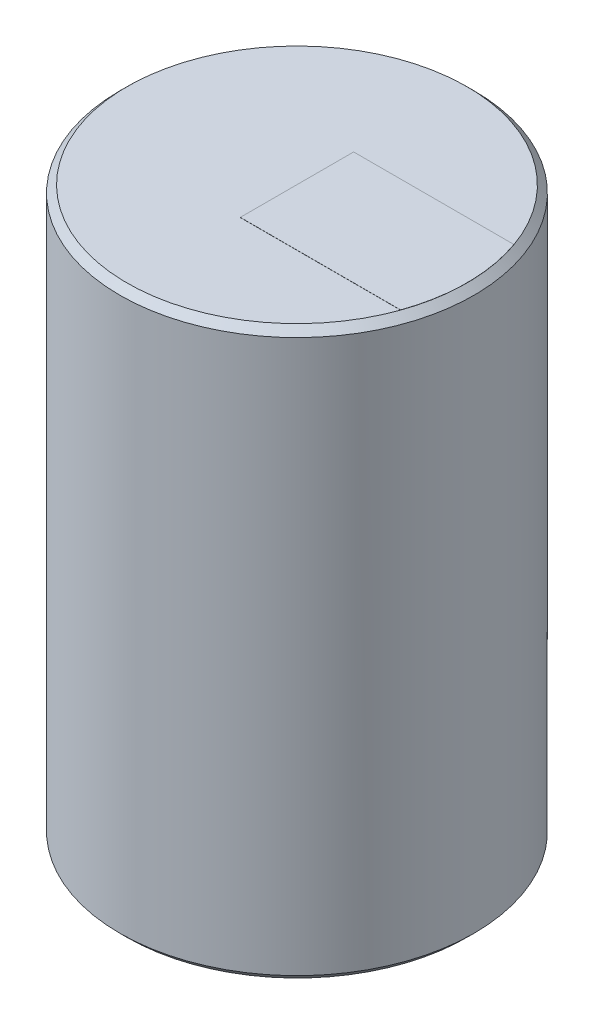
ISO-10303-21;
HEADER;
FILE_DESCRIPTION(('STEP AP214'),'2;1');
FILE_NAME('part.step','',(''),(''),'','','');
FILE_SCHEMA(('AUTOMOTIVE_DESIGN { 1 0 10303 214 1 1 1 1 }'));
ENDSEC;
DATA;
#1=APPLICATION_CONTEXT('core data for automotive mechanical design processes');
#2=APPLICATION_PROTOCOL_DEFINITION('international standard','automotive_design',2000,#1);
#3=PRODUCT_CONTEXT('',#1,'mechanical');
#4=PRODUCT('Part','Part','',(#3));
#5=PRODUCT_RELATED_PRODUCT_CATEGORY('part','',(#4));
#6=PRODUCT_DEFINITION_FORMATION('','',#4);
#7=PRODUCT_DEFINITION_CONTEXT('part definition',#1,'design');
#8=PRODUCT_DEFINITION('design','',#6,#7);
#9=PRODUCT_DEFINITION_SHAPE('','',#8);
#10=(LENGTH_UNIT() NAMED_UNIT(*) SI_UNIT(.MILLI.,.METRE.));
#11=(NAMED_UNIT(*) PLANE_ANGLE_UNIT() SI_UNIT($,.RADIAN.));
#12=(NAMED_UNIT(*) SI_UNIT($,.STERADIAN.) SOLID_ANGLE_UNIT());
#13=UNCERTAINTY_MEASURE_WITH_UNIT(LENGTH_MEASURE(1.E-05),#10,'distance_accuracy_value','');
#14=(GEOMETRIC_REPRESENTATION_CONTEXT(3) GLOBAL_UNCERTAINTY_ASSIGNED_CONTEXT((#13)) GLOBAL_UNIT_ASSIGNED_CONTEXT((#10,
#11,#12)) REPRESENTATION_CONTEXT('',''));
#15=CARTESIAN_POINT('',(0.,0.,0.));
#16=DIRECTION('',(0.,0.,1.));
#17=DIRECTION('',(1.,0.,0.));
#18=AXIS2_PLACEMENT_3D('',#15,#16,#17);
#19=CARTESIAN_POINT('',(0.,40.,0.));
#20=DIRECTION('',(0.,-1.,0.));
#21=DIRECTION('',(0.,0.,-1.));
#22=AXIS2_PLACEMENT_3D('',#19,#20,#21);
#23=CYLINDRICAL_SURFACE('',#22,12.5);
#24=CARTESIAN_POINT('',(0.,0.499999999999994,0.));
#25=DIRECTION('',(0.,1.,0.));
#26=DIRECTION('',(0.,0.,1.));
#27=AXIS2_PLACEMENT_3D('',#24,#25,#26);
#28=CIRCLE('',#27,12.5);
#29=CARTESIAN_POINT('',(0.,0.499999999999994,12.5));
#30=VERTEX_POINT('',#29);
#31=EDGE_CURVE('E101',#30,#30,#28,.T.);
#32=ORIENTED_EDGE('',*,*,#31,.T.);
#33=EDGE_LOOP('',(#32));
#34=FACE_BOUND('',#33,.T.);
#35=CARTESIAN_POINT('',(0.,39.5,0.));
#36=DIRECTION('',(0.,1.,0.));
#37=DIRECTION('',(0.,0.,1.));
#38=AXIS2_PLACEMENT_3D('',#35,#36,#37);
#39=CIRCLE('',#38,12.5);
#40=CARTESIAN_POINT('',(0.,39.5,12.5));
#41=VERTEX_POINT('',#40);
#42=EDGE_CURVE('E98',#41,#41,#39,.F.);
#43=ORIENTED_EDGE('',*,*,#42,.T.);
#44=EDGE_LOOP('',(#43));
#45=FACE_BOUND('',#44,.T.);
#46=ADVANCED_FACE('F35',(#34,#45),#23,.T.);
#47=CARTESIAN_POINT('',(0.,40.,0.));
#48=DIRECTION('',(0.,1.,0.));
#49=DIRECTION('',(0.,0.,1.));
#50=AXIS2_PLACEMENT_3D('',#47,#48,#49);
#51=PLANE('',#50);
#52=DIRECTION('',(1.,0.,0.));
#53=VECTOR('',#52,1.);
#54=CARTESIAN_POINT('',(11.3137084989848,40.,4.));
#55=LINE('',#54,#53);
#56=CARTESIAN_POINT('',(0.,40.,4.));
#57=VERTEX_POINT('',#56);
#58=CARTESIAN_POINT('',(11.3137084989848,40.,4.));
#59=VERTEX_POINT('',#58);
#60=EDGE_CURVE('E51',#57,#59,#55,.T.);
#61=ORIENTED_EDGE('',*,*,#60,.F.);
#62=DIRECTION('',(0.,0.,1.));
#63=VECTOR('',#62,1.);
#64=CARTESIAN_POINT('',(0.,40.,-4.));
#65=LINE('',#64,#63);
#66=CARTESIAN_POINT('',(0.,40.,-4.));
#67=VERTEX_POINT('',#66);
#68=EDGE_CURVE('E119',#67,#57,#65,.T.);
#69=ORIENTED_EDGE('',*,*,#68,.F.);
#70=DIRECTION('',(-1.,0.,0.));
#71=VECTOR('',#70,1.);
#72=CARTESIAN_POINT('',(11.3137084989848,40.,-4.));
#73=LINE('',#72,#71);
#74=CARTESIAN_POINT('',(11.3137084989848,40.,-4.));
#75=VERTEX_POINT('',#74);
#76=EDGE_CURVE('E56',#75,#67,#73,.T.);
#77=ORIENTED_EDGE('',*,*,#76,.F.);
#78=CARTESIAN_POINT('',(0.,40.,0.));
#79=DIRECTION('',(0.,1.,0.));
#80=DIRECTION('',(0.,0.,1.));
#81=AXIS2_PLACEMENT_3D('',#78,#79,#80);
#82=CIRCLE('',#81,12.);
#83=EDGE_CURVE('E44',#75,#59,#82,.T.);
#84=ORIENTED_EDGE('',*,*,#83,.T.);
#85=EDGE_LOOP('',(#61,#69,#77,#84));
#86=FACE_BOUND('',#85,.T.);
#87=ADVANCED_FACE('F112',(#86),#51,.T.);
#88=CARTESIAN_POINT('',(0.,0.,0.));
#89=DIRECTION('',(0.,1.,0.));
#90=DIRECTION('',(0.,0.,1.));
#91=AXIS2_PLACEMENT_3D('',#88,#89,#90);
#92=PLANE('',#91);
#93=CARTESIAN_POINT('',(0.,0.,0.));
#94=DIRECTION('',(0.,1.,0.));
#95=DIRECTION('',(0.,0.,1.));
#96=AXIS2_PLACEMENT_3D('',#93,#94,#95);
#97=CIRCLE('',#96,12.);
#98=CARTESIAN_POINT('',(0.,0.,12.));
#99=VERTEX_POINT('',#98);
#100=EDGE_CURVE('E108',#99,#99,#97,.F.);
#101=ORIENTED_EDGE('',*,*,#100,.T.);
#102=EDGE_LOOP('',(#101));
#103=FACE_BOUND('',#102,.T.);
#104=ADVANCED_FACE('F143',(#103),#92,.F.);
#105=CARTESIAN_POINT('',(0.,0.499999999999994,0.));
#106=DIRECTION('',(0.,1.,0.));
#107=DIRECTION('',(0.,0.,1.));
#108=AXIS2_PLACEMENT_3D('',#105,#106,#107);
#109=CONICAL_SURFACE('',#108,12.5,0.785398163397455);
#110=ORIENTED_EDGE('',*,*,#100,.F.);
#111=EDGE_LOOP('',(#110));
#112=FACE_BOUND('',#111,.T.);
#113=ORIENTED_EDGE('',*,*,#31,.F.);
#114=EDGE_LOOP('',(#113));
#115=FACE_BOUND('',#114,.T.);
#116=ADVANCED_FACE('F148',(#112,#115),#109,.T.);
#117=CARTESIAN_POINT('',(0.,40.,0.));
#118=DIRECTION('',(0.,-1.,0.));
#119=DIRECTION('',(0.,0.,-1.));
#120=AXIS2_PLACEMENT_3D('',#117,#118,#119);
#121=CONICAL_SURFACE('',#120,12.,0.785398163397445);
#122=ORIENTED_EDGE('',*,*,#42,.F.);
#123=EDGE_LOOP('',(#122));
#124=FACE_BOUND('',#123,.T.);
#125=EDGE_CURVE('E11',#59,#75,#82,.T.);
#126=ORIENTED_EDGE('',*,*,#125,.F.);
#127=ORIENTED_EDGE('',*,*,#83,.F.);
#128=EDGE_LOOP('',(#126,#127));
#129=FACE_BOUND('',#128,.T.);
#130=ADVANCED_FACE('F38',(#124,#129),#121,.T.);
#131=CARTESIAN_POINT('',(0.,40.01,0.));
#132=DIRECTION('',(0.,-1.,0.));
#133=DIRECTION('',(0.,0.,-1.));
#134=AXIS2_PLACEMENT_3D('',#131,#132,#133);
#135=CYLINDRICAL_SURFACE('',#134,12.);
#136=ORIENTED_EDGE('',*,*,#125,.T.);
#137=DIRECTION('',(0.,-1.,0.));
#138=VECTOR('',#137,1.);
#139=CARTESIAN_POINT('',(11.3137084989848,40.01,-4.));
#140=LINE('',#139,#138);
#141=CARTESIAN_POINT('',(11.3137084989848,40.01,-4.));
#142=VERTEX_POINT('',#141);
#143=EDGE_CURVE('E80',#142,#75,#140,.T.);
#144=ORIENTED_EDGE('',*,*,#143,.F.);
#145=CARTESIAN_POINT('',(0.,40.01,0.));
#146=DIRECTION('',(0.,1.,0.));
#147=DIRECTION('',(0.,0.,1.));
#148=AXIS2_PLACEMENT_3D('',#145,#146,#147);
#149=CIRCLE('',#148,12.);
#150=CARTESIAN_POINT('',(11.3137084989848,40.01,4.));
#151=VERTEX_POINT('',#150);
#152=EDGE_CURVE('E86',#151,#142,#149,.T.);
#153=ORIENTED_EDGE('',*,*,#152,.F.);
#154=DIRECTION('',(0.,-1.,0.));
#155=VECTOR('',#154,1.);
#156=CARTESIAN_POINT('',(11.3137084989848,40.01,4.));
#157=LINE('',#156,#155);
#158=EDGE_CURVE('E117',#151,#59,#157,.T.);
#159=ORIENTED_EDGE('',*,*,#158,.T.);
#160=EDGE_LOOP('',(#136,#144,#153,#159));
#161=FACE_BOUND('',#160,.T.);
#162=ADVANCED_FACE('F96',(#161),#135,.T.);
#163=CARTESIAN_POINT('',(11.3137084989848,40.01,-4.));
#164=DIRECTION('',(0.,0.,1.));
#165=DIRECTION('',(1.,0.,0.));
#166=AXIS2_PLACEMENT_3D('',#163,#164,#165);
#167=PLANE('',#166);
#168=ORIENTED_EDGE('',*,*,#76,.T.);
#169=DIRECTION('',(0.,-1.,0.));
#170=VECTOR('',#169,1.);
#171=CARTESIAN_POINT('',(0.,40.01,-4.));
#172=LINE('',#171,#170);
#173=CARTESIAN_POINT('',(0.,40.01,-4.));
#174=VERTEX_POINT('',#173);
#175=EDGE_CURVE('E82',#174,#67,#172,.T.);
#176=ORIENTED_EDGE('',*,*,#175,.F.);
#177=DIRECTION('',(-1.,0.,0.));
#178=VECTOR('',#177,1.);
#179=CARTESIAN_POINT('',(11.3137084989848,40.01,-4.));
#180=LINE('',#179,#178);
#181=EDGE_CURVE('E76',#142,#174,#180,.T.);
#182=ORIENTED_EDGE('',*,*,#181,.F.);
#183=ORIENTED_EDGE('',*,*,#143,.T.);
#184=EDGE_LOOP('',(#168,#176,#182,#183));
#185=FACE_BOUND('',#184,.T.);
#186=ADVANCED_FACE('F78',(#185),#167,.F.);
#187=CARTESIAN_POINT('',(0.,40.01,-4.));
#188=DIRECTION('',(1.,0.,0.));
#189=DIRECTION('',(0.,0.,-1.));
#190=AXIS2_PLACEMENT_3D('',#187,#188,#189);
#191=PLANE('',#190);
#192=ORIENTED_EDGE('',*,*,#68,.T.);
#193=DIRECTION('',(0.,-1.,0.));
#194=VECTOR('',#193,1.);
#195=CARTESIAN_POINT('',(0.,40.01,4.));
#196=LINE('',#195,#194);
#197=CARTESIAN_POINT('',(0.,40.01,4.));
#198=VERTEX_POINT('',#197);
#199=EDGE_CURVE('E103',#198,#57,#196,.T.);
#200=ORIENTED_EDGE('',*,*,#199,.F.);
#201=DIRECTION('',(0.,0.,1.));
#202=VECTOR('',#201,1.);
#203=CARTESIAN_POINT('',(0.,40.01,-4.));
#204=LINE('',#203,#202);
#205=EDGE_CURVE('E85',#174,#198,#204,.T.);
#206=ORIENTED_EDGE('',*,*,#205,.F.);
#207=ORIENTED_EDGE('',*,*,#175,.T.);
#208=EDGE_LOOP('',(#192,#200,#206,#207));
#209=FACE_BOUND('',#208,.T.);
#210=ADVANCED_FACE('F127',(#209),#191,.F.);
#211=CARTESIAN_POINT('',(11.3137084989848,40.01,4.));
#212=DIRECTION('',(0.,0.,-1.));
#213=DIRECTION('',(-1.,0.,0.));
#214=AXIS2_PLACEMENT_3D('',#211,#212,#213);
#215=PLANE('',#214);
#216=ORIENTED_EDGE('',*,*,#60,.T.);
#217=ORIENTED_EDGE('',*,*,#158,.F.);
#218=DIRECTION('',(1.,0.,0.));
#219=VECTOR('',#218,1.);
#220=CARTESIAN_POINT('',(11.3137084989848,40.01,4.));
#221=LINE('',#220,#219);
#222=EDGE_CURVE('E91',#198,#151,#221,.T.);
#223=ORIENTED_EDGE('',*,*,#222,.F.);
#224=ORIENTED_EDGE('',*,*,#199,.T.);
#225=EDGE_LOOP('',(#216,#217,#223,#224));
#226=FACE_BOUND('',#225,.T.);
#227=ADVANCED_FACE('F116',(#226),#215,.F.);
#228=CARTESIAN_POINT('',(0.,40.01,0.));
#229=DIRECTION('',(0.,1.,0.));
#230=DIRECTION('',(0.,0.,1.));
#231=AXIS2_PLACEMENT_3D('',#228,#229,#230);
#232=PLANE('',#231);
#233=ORIENTED_EDGE('',*,*,#152,.T.);
#234=ORIENTED_EDGE('',*,*,#181,.T.);
#235=ORIENTED_EDGE('',*,*,#205,.T.);
#236=ORIENTED_EDGE('',*,*,#222,.T.);
#237=EDGE_LOOP('',(#233,#234,#235,#236));
#238=FACE_BOUND('',#237,.T.);
#239=ADVANCED_FACE('F89',(#238),#232,.T.);
#240=CLOSED_SHELL('',(#46,#87,#104,#116,#130,#162,#186,#210,#227,#239));
#241=MANIFOLD_SOLID_BREP('B2',#240);
#242=ADVANCED_BREP_SHAPE_REPRESENTATION('',(#18,#241),#14);
#243=SHAPE_DEFINITION_REPRESENTATION(#9,#242);
ENDSEC;
END-ISO-10303-21;
